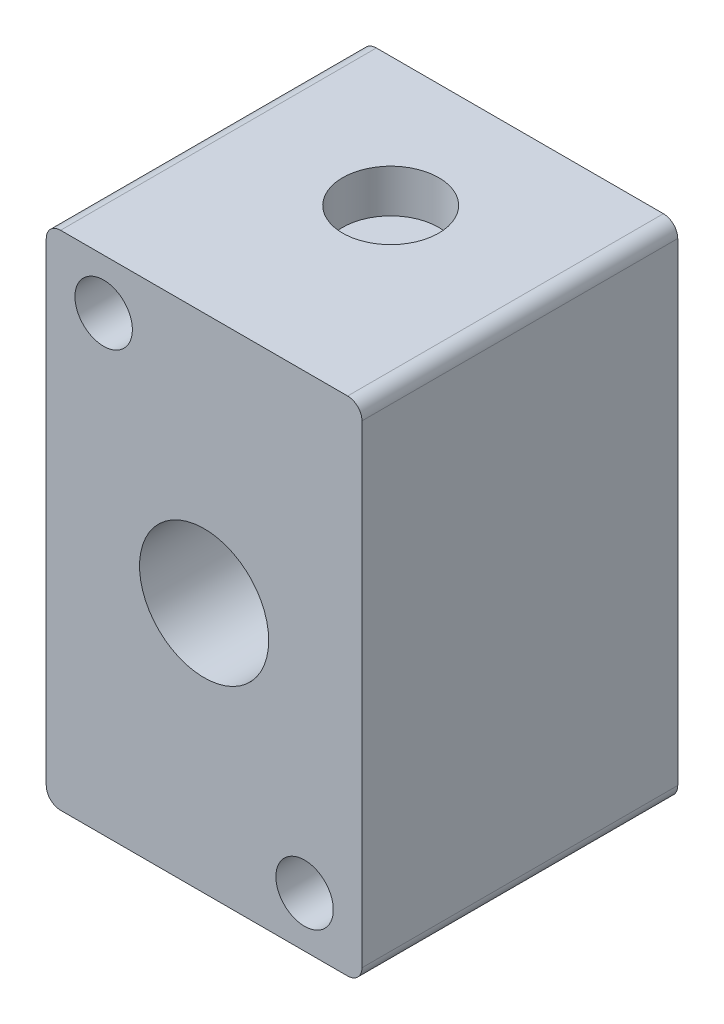
ISO-10303-21;
HEADER;
FILE_DESCRIPTION(('STEP AP214'),'2;1');
FILE_NAME('part.step','',(''),(''),'','','');
FILE_SCHEMA(('AUTOMOTIVE_DESIGN { 1 0 10303 214 1 1 1 1 }'));
ENDSEC;
DATA;
#1=APPLICATION_CONTEXT('core data for automotive mechanical design processes');
#2=APPLICATION_PROTOCOL_DEFINITION('international standard','automotive_design',2000,#1);
#3=PRODUCT_CONTEXT('',#1,'mechanical');
#4=PRODUCT('Part','Part','',(#3));
#5=PRODUCT_RELATED_PRODUCT_CATEGORY('part','',(#4));
#6=PRODUCT_DEFINITION_FORMATION('','',#4);
#7=PRODUCT_DEFINITION_CONTEXT('part definition',#1,'design');
#8=PRODUCT_DEFINITION('design','',#6,#7);
#9=PRODUCT_DEFINITION_SHAPE('','',#8);
#10=(LENGTH_UNIT() NAMED_UNIT(*) SI_UNIT(.MILLI.,.METRE.));
#11=(NAMED_UNIT(*) PLANE_ANGLE_UNIT() SI_UNIT($,.RADIAN.));
#12=(NAMED_UNIT(*) SI_UNIT($,.STERADIAN.) SOLID_ANGLE_UNIT());
#13=UNCERTAINTY_MEASURE_WITH_UNIT(LENGTH_MEASURE(1.E-05),#10,'distance_accuracy_value','');
#14=(GEOMETRIC_REPRESENTATION_CONTEXT(3) GLOBAL_UNCERTAINTY_ASSIGNED_CONTEXT((#13)) GLOBAL_UNIT_ASSIGNED_CONTEXT((#10,
#11,#12)) REPRESENTATION_CONTEXT('',''));
#15=CARTESIAN_POINT('',(0.,0.,0.));
#16=DIRECTION('',(0.,0.,1.));
#17=DIRECTION('',(1.,0.,0.));
#18=AXIS2_PLACEMENT_3D('',#15,#16,#17);
#19=CARTESIAN_POINT('',(-5.86092041698449,15.4504195270786,53.));
#20=DIRECTION('',(0.,1.,0.));
#21=DIRECTION('',(0.,0.,1.));
#22=AXIS2_PLACEMENT_3D('',#19,#20,#21);
#23=PLANE('',#22);
#24=CARTESIAN_POINT('',(-5.86092041698449,15.4504195270786,53.));
#25=DIRECTION('',(0.,-1.,0.));
#26=DIRECTION('',(0.,0.,-1.));
#27=AXIS2_PLACEMENT_3D('',#24,#25,#26);
#28=CIRCLE('',#27,3.35);
#29=CARTESIAN_POINT('',(-5.86092041698449,15.4504195270786,49.65));
#30=VERTEX_POINT('',#29);
#31=EDGE_CURVE('E158',#30,#30,#28,.F.);
#32=ORIENTED_EDGE('',*,*,#31,.T.);
#33=EDGE_LOOP('',(#32));
#34=FACE_BOUND('',#33,.T.);
#35=ADVANCED_FACE('F18',(#34),#23,.T.);
#36=CARTESIAN_POINT('',(-15.8609204169845,17.4504195270786,66.));
#37=DIRECTION('',(0.,0.,1.));
#38=DIRECTION('',(1.,0.,0.));
#39=AXIS2_PLACEMENT_3D('',#36,#37,#38);
#40=CYLINDRICAL_SURFACE('',#39,1.);
#41=CARTESIAN_POINT('',(-15.8609204169845,17.4504195270786,66.));
#42=DIRECTION('',(0.,0.,1.));
#43=DIRECTION('',(1.,0.,0.));
#44=AXIS2_PLACEMENT_3D('',#41,#42,#43);
#45=CIRCLE('',#44,1.);
#46=CARTESIAN_POINT('',(-16.8609204169845,17.4504195270786,66.));
#47=VERTEX_POINT('',#46);
#48=CARTESIAN_POINT('',(-15.8609204169845,18.4504195270786,66.));
#49=VERTEX_POINT('',#48);
#50=EDGE_CURVE('E90',#47,#49,#45,.F.);
#51=ORIENTED_EDGE('',*,*,#50,.T.);
#52=DIRECTION('',(0.,0.,1.));
#53=VECTOR('',#52,1.);
#54=CARTESIAN_POINT('',(-15.8609204169845,18.4504195270786,66.));
#55=LINE('',#54,#53);
#56=CARTESIAN_POINT('',(-15.8609204169845,18.4504195270786,44.));
#57=VERTEX_POINT('',#56);
#58=EDGE_CURVE('E88',#57,#49,#55,.T.);
#59=ORIENTED_EDGE('',*,*,#58,.F.);
#60=CARTESIAN_POINT('',(-15.8609204169845,17.4504195270786,44.));
#61=DIRECTION('',(0.,0.,1.));
#62=DIRECTION('',(1.,0.,0.));
#63=AXIS2_PLACEMENT_3D('',#60,#61,#62);
#64=CIRCLE('',#63,1.);
#65=CARTESIAN_POINT('',(-16.8609204169845,17.4504195270786,44.));
#66=VERTEX_POINT('',#65);
#67=EDGE_CURVE('E21',#57,#66,#64,.T.);
#68=ORIENTED_EDGE('',*,*,#67,.T.);
#69=DIRECTION('',(0.,0.,1.));
#70=VECTOR('',#69,1.);
#71=CARTESIAN_POINT('',(-16.8609204169845,17.4504195270786,66.));
#72=LINE('',#71,#70);
#73=EDGE_CURVE('E85',#47,#66,#72,.F.);
#74=ORIENTED_EDGE('',*,*,#73,.F.);
#75=EDGE_LOOP('',(#51,#59,#68,#74));
#76=FACE_BOUND('',#75,.T.);
#77=ADVANCED_FACE('F84',(#76),#40,.T.);
#78=CARTESIAN_POINT('',(-5.86092041698449,15.4504195270786,53.));
#79=DIRECTION('',(0.,-1.,0.));
#80=DIRECTION('',(0.,0.,-1.));
#81=AXIS2_PLACEMENT_3D('',#78,#79,#80);
#82=CYLINDRICAL_SURFACE('',#81,3.35);
#83=CARTESIAN_POINT('',(-5.86092041698449,18.4504195270786,53.));
#84=DIRECTION('',(0.,-1.,0.));
#85=DIRECTION('',(0.,0.,-1.));
#86=AXIS2_PLACEMENT_3D('',#83,#84,#85);
#87=CIRCLE('',#86,3.35);
#88=CARTESIAN_POINT('',(-5.86092041698449,18.4504195270786,49.65));
#89=VERTEX_POINT('',#88);
#90=EDGE_CURVE('E119',#89,#89,#87,.T.);
#91=ORIENTED_EDGE('',*,*,#90,.F.);
#92=EDGE_LOOP('',(#91));
#93=FACE_BOUND('',#92,.T.);
#94=ORIENTED_EDGE('',*,*,#31,.F.);
#95=EDGE_LOOP('',(#94));
#96=FACE_BOUND('',#95,.T.);
#97=ADVANCED_FACE('F189',(#93,#96),#82,.F.);
#98=CARTESIAN_POINT('',(-15.8609204169845,-15.5495804729214,66.));
#99=DIRECTION('',(0.,0.,1.));
#100=DIRECTION('',(1.,0.,0.));
#101=AXIS2_PLACEMENT_3D('',#98,#99,#100);
#102=CYLINDRICAL_SURFACE('',#101,1.);
#103=CARTESIAN_POINT('',(-15.8609204169845,-15.5495804729214,66.));
#104=DIRECTION('',(0.,0.,1.));
#105=DIRECTION('',(1.,0.,0.));
#106=AXIS2_PLACEMENT_3D('',#103,#104,#105);
#107=CIRCLE('',#106,1.);
#108=CARTESIAN_POINT('',(-15.8609204169845,-16.5495804729214,66.));
#109=VERTEX_POINT('',#108);
#110=CARTESIAN_POINT('',(-16.8609204169845,-15.5495804729214,66.));
#111=VERTEX_POINT('',#110);
#112=EDGE_CURVE('E99',#109,#111,#107,.F.);
#113=ORIENTED_EDGE('',*,*,#112,.T.);
#114=DIRECTION('',(0.,0.,1.));
#115=VECTOR('',#114,1.);
#116=CARTESIAN_POINT('',(-16.8609204169845,-15.5495804729214,66.));
#117=LINE('',#116,#115);
#118=CARTESIAN_POINT('',(-16.8609204169845,-15.5495804729214,44.));
#119=VERTEX_POINT('',#118);
#120=EDGE_CURVE('E98',#119,#111,#117,.T.);
#121=ORIENTED_EDGE('',*,*,#120,.F.);
#122=CARTESIAN_POINT('',(-15.8609204169845,-15.5495804729214,44.));
#123=DIRECTION('',(0.,0.,1.));
#124=DIRECTION('',(1.,0.,0.));
#125=AXIS2_PLACEMENT_3D('',#122,#123,#124);
#126=CIRCLE('',#125,1.);
#127=CARTESIAN_POINT('',(-15.8609204169845,-16.5495804729214,44.));
#128=VERTEX_POINT('',#127);
#129=EDGE_CURVE('E103',#119,#128,#126,.T.);
#130=ORIENTED_EDGE('',*,*,#129,.T.);
#131=DIRECTION('',(0.,0.,1.));
#132=VECTOR('',#131,1.);
#133=CARTESIAN_POINT('',(-15.8609204169845,-16.5495804729214,66.));
#134=LINE('',#133,#132);
#135=EDGE_CURVE('E110',#109,#128,#134,.F.);
#136=ORIENTED_EDGE('',*,*,#135,.F.);
#137=EDGE_LOOP('',(#113,#121,#130,#136));
#138=FACE_BOUND('',#137,.T.);
#139=ADVANCED_FACE('F187',(#138),#102,.T.);
#140=CARTESIAN_POINT('',(-16.8609204169845,18.4504195270786,66.));
#141=DIRECTION('',(-1.,0.,0.));
#142=DIRECTION('',(0.,-1.,0.));
#143=AXIS2_PLACEMENT_3D('',#140,#141,#142);
#144=PLANE('',#143);
#145=DIRECTION('',(0.,1.,0.));
#146=VECTOR('',#145,1.);
#147=CARTESIAN_POINT('',(-16.8609204169845,0.950419527078566,44.));
#148=LINE('',#147,#146);
#149=EDGE_CURVE('E95',#66,#119,#148,.F.);
#150=ORIENTED_EDGE('',*,*,#149,.T.);
#151=ORIENTED_EDGE('',*,*,#120,.T.);
#152=DIRECTION('',(0.,1.,0.));
#153=VECTOR('',#152,1.);
#154=CARTESIAN_POINT('',(-16.8609204169845,0.950419527078566,66.));
#155=LINE('',#154,#153);
#156=EDGE_CURVE('E97',#47,#111,#155,.F.);
#157=ORIENTED_EDGE('',*,*,#156,.F.);
#158=ORIENTED_EDGE('',*,*,#73,.T.);
#159=EDGE_LOOP('',(#150,#151,#157,#158));
#160=FACE_BOUND('',#159,.T.);
#161=ADVANCED_FACE('F93',(#160),#144,.T.);
#162=CARTESIAN_POINT('',(5.13907958301551,18.4504195270786,66.));
#163=DIRECTION('',(0.,1.,0.));
#164=DIRECTION('',(0.,0.,1.));
#165=AXIS2_PLACEMENT_3D('',#162,#163,#164);
#166=PLANE('',#165);
#167=ORIENTED_EDGE('',*,*,#90,.T.);
#168=EDGE_LOOP('',(#167));
#169=FACE_BOUND('',#168,.T.);
#170=DIRECTION('',(1.,0.,0.));
#171=VECTOR('',#170,1.);
#172=CARTESIAN_POINT('',(-5.86092041698449,18.4504195270786,66.));
#173=LINE('',#172,#171);
#174=CARTESIAN_POINT('',(4.13907958301551,18.4504195270786,66.));
#175=VERTEX_POINT('',#174);
#176=EDGE_CURVE('E139',#175,#49,#173,.F.);
#177=ORIENTED_EDGE('',*,*,#176,.F.);
#178=DIRECTION('',(0.,0.,1.));
#179=VECTOR('',#178,1.);
#180=CARTESIAN_POINT('',(4.13907958301551,18.4504195270786,66.));
#181=LINE('',#180,#179);
#182=CARTESIAN_POINT('',(4.13907958301551,18.4504195270786,44.));
#183=VERTEX_POINT('',#182);
#184=EDGE_CURVE('E120',#183,#175,#181,.T.);
#185=ORIENTED_EDGE('',*,*,#184,.F.);
#186=DIRECTION('',(1.,0.,0.));
#187=VECTOR('',#186,1.);
#188=CARTESIAN_POINT('',(-5.86092041698449,18.4504195270786,44.));
#189=LINE('',#188,#187);
#190=EDGE_CURVE('E106',#183,#57,#189,.F.);
#191=ORIENTED_EDGE('',*,*,#190,.T.);
#192=ORIENTED_EDGE('',*,*,#58,.T.);
#193=EDGE_LOOP('',(#177,#185,#191,#192));
#194=FACE_BOUND('',#193,.T.);
#195=ADVANCED_FACE('F163',(#169,#194),#166,.T.);
#196=CARTESIAN_POINT('',(-5.86092041698449,0.950419527078566,66.));
#197=DIRECTION('',(0.,0.,1.));
#198=DIRECTION('',(1.,0.,0.));
#199=AXIS2_PLACEMENT_3D('',#196,#197,#198);
#200=CYLINDRICAL_SURFACE('',#199,4.5);
#201=CARTESIAN_POINT('',(-5.86092041698449,0.950419527078566,66.));
#202=DIRECTION('',(0.,0.,1.));
#203=DIRECTION('',(1.,0.,0.));
#204=AXIS2_PLACEMENT_3D('',#201,#202,#203);
#205=CIRCLE('',#204,4.5);
#206=CARTESIAN_POINT('',(-1.36092041698449,0.950419527078566,66.));
#207=VERTEX_POINT('',#206);
#208=EDGE_CURVE('E136',#207,#207,#205,.F.);
#209=ORIENTED_EDGE('',*,*,#208,.F.);
#210=EDGE_LOOP('',(#209));
#211=FACE_BOUND('',#210,.T.);
#212=CARTESIAN_POINT('',(-5.86092041698449,0.950419527078566,44.));
#213=DIRECTION('',(0.,0.,1.));
#214=DIRECTION('',(1.,0.,0.));
#215=AXIS2_PLACEMENT_3D('',#212,#213,#214);
#216=CIRCLE('',#215,4.5);
#217=CARTESIAN_POINT('',(-1.36092041698449,0.950419527078566,44.));
#218=VERTEX_POINT('',#217);
#219=EDGE_CURVE('E108',#218,#218,#216,.F.);
#220=ORIENTED_EDGE('',*,*,#219,.T.);
#221=EDGE_LOOP('',(#220));
#222=FACE_BOUND('',#221,.T.);
#223=ADVANCED_FACE('F225',(#211,#222),#200,.F.);
#224=CARTESIAN_POINT('',(-12.8609204169845,14.9504195270786,44.));
#225=DIRECTION('',(0.,0.,-1.));
#226=DIRECTION('',(-1.,0.,0.));
#227=AXIS2_PLACEMENT_3D('',#224,#225,#226);
#228=CYLINDRICAL_SURFACE('',#227,2.);
#229=CARTESIAN_POINT('',(-12.8609204169845,14.9504195270786,66.));
#230=DIRECTION('',(0.,0.,-1.));
#231=DIRECTION('',(-1.,0.,0.));
#232=AXIS2_PLACEMENT_3D('',#229,#230,#231);
#233=CIRCLE('',#232,2.);
#234=CARTESIAN_POINT('',(-14.8609204169845,14.9504195270786,66.));
#235=VERTEX_POINT('',#234);
#236=EDGE_CURVE('E133',#235,#235,#233,.T.);
#237=ORIENTED_EDGE('',*,*,#236,.F.);
#238=EDGE_LOOP('',(#237));
#239=FACE_BOUND('',#238,.T.);
#240=CARTESIAN_POINT('',(-12.8609204169845,14.9504195270786,44.));
#241=DIRECTION('',(0.,0.,-1.));
#242=DIRECTION('',(-1.,0.,0.));
#243=AXIS2_PLACEMENT_3D('',#240,#241,#242);
#244=CIRCLE('',#243,2.);
#245=CARTESIAN_POINT('',(-14.8609204169845,14.9504195270786,44.));
#246=VERTEX_POINT('',#245);
#247=EDGE_CURVE('E149',#246,#246,#244,.T.);
#248=ORIENTED_EDGE('',*,*,#247,.T.);
#249=EDGE_LOOP('',(#248));
#250=FACE_BOUND('',#249,.T.);
#251=ADVANCED_FACE('F221',(#239,#250),#228,.F.);
#252=CARTESIAN_POINT('',(1.13907958301552,-13.0495804729214,44.));
#253=DIRECTION('',(0.,0.,-1.));
#254=DIRECTION('',(-1.,0.,0.));
#255=AXIS2_PLACEMENT_3D('',#252,#253,#254);
#256=CYLINDRICAL_SURFACE('',#255,2.);
#257=CARTESIAN_POINT('',(1.13907958301552,-13.0495804729214,66.));
#258=DIRECTION('',(0.,0.,-1.));
#259=DIRECTION('',(-1.,0.,0.));
#260=AXIS2_PLACEMENT_3D('',#257,#258,#259);
#261=CIRCLE('',#260,2.);
#262=CARTESIAN_POINT('',(-0.860920416984483,-13.0495804729214,66.));
#263=VERTEX_POINT('',#262);
#264=EDGE_CURVE('E130',#263,#263,#261,.T.);
#265=ORIENTED_EDGE('',*,*,#264,.F.);
#266=EDGE_LOOP('',(#265));
#267=FACE_BOUND('',#266,.T.);
#268=CARTESIAN_POINT('',(1.13907958301552,-13.0495804729214,44.));
#269=DIRECTION('',(0.,0.,-1.));
#270=DIRECTION('',(-1.,0.,0.));
#271=AXIS2_PLACEMENT_3D('',#268,#269,#270);
#272=CIRCLE('',#271,2.);
#273=CARTESIAN_POINT('',(-0.860920416984483,-13.0495804729214,44.));
#274=VERTEX_POINT('',#273);
#275=EDGE_CURVE('E146',#274,#274,#272,.T.);
#276=ORIENTED_EDGE('',*,*,#275,.T.);
#277=EDGE_LOOP('',(#276));
#278=FACE_BOUND('',#277,.T.);
#279=ADVANCED_FACE('F218',(#267,#278),#256,.F.);
#280=CARTESIAN_POINT('',(-16.8609204169845,-16.5495804729214,66.));
#281=DIRECTION('',(0.,-1.,0.));
#282=DIRECTION('',(1.,0.,0.));
#283=AXIS2_PLACEMENT_3D('',#280,#281,#282);
#284=PLANE('',#283);
#285=DIRECTION('',(1.,0.,0.));
#286=VECTOR('',#285,1.);
#287=CARTESIAN_POINT('',(-5.86092041698449,-16.5495804729214,44.));
#288=LINE('',#287,#286);
#289=CARTESIAN_POINT('',(4.13907958301551,-16.5495804729214,44.));
#290=VERTEX_POINT('',#289);
#291=EDGE_CURVE('E105',#128,#290,#288,.T.);
#292=ORIENTED_EDGE('',*,*,#291,.T.);
#293=DIRECTION('',(0.,0.,1.));
#294=VECTOR('',#293,1.);
#295=CARTESIAN_POINT('',(4.13907958301551,-16.5495804729214,66.));
#296=LINE('',#295,#294);
#297=CARTESIAN_POINT('',(4.13907958301551,-16.5495804729214,66.));
#298=VERTEX_POINT('',#297);
#299=EDGE_CURVE('E114',#298,#290,#296,.F.);
#300=ORIENTED_EDGE('',*,*,#299,.F.);
#301=DIRECTION('',(1.,0.,0.));
#302=VECTOR('',#301,1.);
#303=CARTESIAN_POINT('',(-5.86092041698449,-16.5495804729214,66.));
#304=LINE('',#303,#302);
#305=EDGE_CURVE('E143',#109,#298,#304,.T.);
#306=ORIENTED_EDGE('',*,*,#305,.F.);
#307=ORIENTED_EDGE('',*,*,#135,.T.);
#308=EDGE_LOOP('',(#292,#300,#306,#307));
#309=FACE_BOUND('',#308,.T.);
#310=ADVANCED_FACE('F184',(#309),#284,.T.);
#311=CARTESIAN_POINT('',(-5.86092041698449,0.950419527078566,44.));
#312=DIRECTION('',(0.,0.,1.));
#313=DIRECTION('',(1.,0.,0.));
#314=AXIS2_PLACEMENT_3D('',#311,#312,#313);
#315=PLANE('',#314);
#316=ORIENTED_EDGE('',*,*,#275,.F.);
#317=EDGE_LOOP('',(#316));
#318=FACE_BOUND('',#317,.T.);
#319=ORIENTED_EDGE('',*,*,#247,.F.);
#320=EDGE_LOOP('',(#319));
#321=FACE_BOUND('',#320,.T.);
#322=ORIENTED_EDGE('',*,*,#219,.F.);
#323=EDGE_LOOP('',(#322));
#324=FACE_BOUND('',#323,.T.);
#325=ORIENTED_EDGE('',*,*,#291,.F.);
#326=ORIENTED_EDGE('',*,*,#129,.F.);
#327=ORIENTED_EDGE('',*,*,#149,.F.);
#328=ORIENTED_EDGE('',*,*,#67,.F.);
#329=ORIENTED_EDGE('',*,*,#190,.F.);
#330=CARTESIAN_POINT('',(4.13907958301551,17.4504195270786,44.));
#331=DIRECTION('',(0.,0.,1.));
#332=DIRECTION('',(1.,0.,0.));
#333=AXIS2_PLACEMENT_3D('',#330,#331,#332);
#334=CIRCLE('',#333,1.);
#335=CARTESIAN_POINT('',(5.13907958301551,17.4504195270786,44.));
#336=VERTEX_POINT('',#335);
#337=EDGE_CURVE('E122',#336,#183,#334,.T.);
#338=ORIENTED_EDGE('',*,*,#337,.F.);
#339=DIRECTION('',(0.,1.,0.));
#340=VECTOR('',#339,1.);
#341=CARTESIAN_POINT('',(5.13907958301551,-16.5495804729214,44.));
#342=LINE('',#341,#340);
#343=CARTESIAN_POINT('',(5.13907958301551,-15.5495804729214,44.));
#344=VERTEX_POINT('',#343);
#345=EDGE_CURVE('E117',#344,#336,#342,.T.);
#346=ORIENTED_EDGE('',*,*,#345,.F.);
#347=CARTESIAN_POINT('',(4.13907958301551,-15.5495804729214,44.));
#348=DIRECTION('',(0.,0.,1.));
#349=DIRECTION('',(1.,0.,0.));
#350=AXIS2_PLACEMENT_3D('',#347,#348,#349);
#351=CIRCLE('',#350,1.);
#352=EDGE_CURVE('E127',#290,#344,#351,.T.);
#353=ORIENTED_EDGE('',*,*,#352,.F.);
#354=EDGE_LOOP('',(#325,#326,#327,#328,#329,#338,#346,#353));
#355=FACE_BOUND('',#354,.T.);
#356=ADVANCED_FACE('F102',(#318,#321,#324,#355),#315,.F.);
#357=CARTESIAN_POINT('',(4.13907958301551,17.4504195270786,66.));
#358=DIRECTION('',(0.,0.,1.));
#359=DIRECTION('',(1.,0.,0.));
#360=AXIS2_PLACEMENT_3D('',#357,#358,#359);
#361=CYLINDRICAL_SURFACE('',#360,1.);
#362=CARTESIAN_POINT('',(4.13907958301551,17.4504195270786,66.));
#363=DIRECTION('',(0.,0.,1.));
#364=DIRECTION('',(1.,0.,0.));
#365=AXIS2_PLACEMENT_3D('',#362,#363,#364);
#366=CIRCLE('',#365,1.);
#367=CARTESIAN_POINT('',(5.13907958301551,17.4504195270786,66.));
#368=VERTEX_POINT('',#367);
#369=EDGE_CURVE('E140',#368,#175,#366,.T.);
#370=ORIENTED_EDGE('',*,*,#369,.F.);
#371=DIRECTION('',(0.,0.,-1.));
#372=VECTOR('',#371,1.);
#373=CARTESIAN_POINT('',(5.13907958301551,17.4504195270786,66.));
#374=LINE('',#373,#372);
#375=EDGE_CURVE('E170',#336,#368,#374,.F.);
#376=ORIENTED_EDGE('',*,*,#375,.F.);
#377=ORIENTED_EDGE('',*,*,#337,.T.);
#378=ORIENTED_EDGE('',*,*,#184,.T.);
#379=EDGE_LOOP('',(#370,#376,#377,#378));
#380=FACE_BOUND('',#379,.T.);
#381=ADVANCED_FACE('F208',(#380),#361,.T.);
#382=CARTESIAN_POINT('',(-5.86092041698449,0.950419527078566,66.));
#383=DIRECTION('',(0.,0.,1.));
#384=DIRECTION('',(1.,0.,0.));
#385=AXIS2_PLACEMENT_3D('',#382,#383,#384);
#386=PLANE('',#385);
#387=ORIENTED_EDGE('',*,*,#264,.T.);
#388=EDGE_LOOP('',(#387));
#389=FACE_BOUND('',#388,.T.);
#390=ORIENTED_EDGE('',*,*,#236,.T.);
#391=EDGE_LOOP('',(#390));
#392=FACE_BOUND('',#391,.T.);
#393=ORIENTED_EDGE('',*,*,#208,.T.);
#394=EDGE_LOOP('',(#393));
#395=FACE_BOUND('',#394,.T.);
#396=ORIENTED_EDGE('',*,*,#176,.T.);
#397=ORIENTED_EDGE('',*,*,#50,.F.);
#398=ORIENTED_EDGE('',*,*,#156,.T.);
#399=ORIENTED_EDGE('',*,*,#112,.F.);
#400=ORIENTED_EDGE('',*,*,#305,.T.);
#401=CARTESIAN_POINT('',(4.13907958301551,-15.5495804729214,66.));
#402=DIRECTION('',(0.,0.,1.));
#403=DIRECTION('',(1.,0.,0.));
#404=AXIS2_PLACEMENT_3D('',#401,#402,#403);
#405=CIRCLE('',#404,1.);
#406=CARTESIAN_POINT('',(5.13907958301551,-15.5495804729214,66.));
#407=VERTEX_POINT('',#406);
#408=EDGE_CURVE('E36',#407,#298,#405,.F.);
#409=ORIENTED_EDGE('',*,*,#408,.F.);
#410=DIRECTION('',(0.,1.,0.));
#411=VECTOR('',#410,1.);
#412=CARTESIAN_POINT('',(5.13907958301551,-16.5495804729214,66.));
#413=LINE('',#412,#411);
#414=EDGE_CURVE('E27',#368,#407,#413,.F.);
#415=ORIENTED_EDGE('',*,*,#414,.F.);
#416=ORIENTED_EDGE('',*,*,#369,.T.);
#417=EDGE_LOOP('',(#396,#397,#398,#399,#400,#409,#415,#416));
#418=FACE_BOUND('',#417,.T.);
#419=ADVANCED_FACE('F165',(#389,#392,#395,#418),#386,.T.);
#420=CARTESIAN_POINT('',(4.13907958301551,-15.5495804729214,66.));
#421=DIRECTION('',(0.,0.,1.));
#422=DIRECTION('',(1.,0.,0.));
#423=AXIS2_PLACEMENT_3D('',#420,#421,#422);
#424=CYLINDRICAL_SURFACE('',#423,1.);
#425=ORIENTED_EDGE('',*,*,#408,.T.);
#426=ORIENTED_EDGE('',*,*,#299,.T.);
#427=ORIENTED_EDGE('',*,*,#352,.T.);
#428=DIRECTION('',(0.,0.,-1.));
#429=VECTOR('',#428,1.);
#430=CARTESIAN_POINT('',(5.13907958301551,-15.5495804729214,66.));
#431=LINE('',#430,#429);
#432=EDGE_CURVE('E11',#407,#344,#431,.T.);
#433=ORIENTED_EDGE('',*,*,#432,.F.);
#434=EDGE_LOOP('',(#425,#426,#427,#433));
#435=FACE_BOUND('',#434,.T.);
#436=ADVANCED_FACE('F180',(#435),#424,.T.);
#437=CARTESIAN_POINT('',(5.13907958301551,-16.5495804729214,66.));
#438=DIRECTION('',(1.,0.,0.));
#439=DIRECTION('',(0.,0.,-1.));
#440=AXIS2_PLACEMENT_3D('',#437,#438,#439);
#441=PLANE('',#440);
#442=ORIENTED_EDGE('',*,*,#414,.T.);
#443=ORIENTED_EDGE('',*,*,#432,.T.);
#444=ORIENTED_EDGE('',*,*,#345,.T.);
#445=ORIENTED_EDGE('',*,*,#375,.T.);
#446=EDGE_LOOP('',(#442,#443,#444,#445));
#447=FACE_BOUND('',#446,.T.);
#448=ADVANCED_FACE('F176',(#447),#441,.T.);
#449=CLOSED_SHELL('',(#35,#77,#97,#139,#161,#195,#223,#251,#279,#310,#356,#381,#419,#436,#448));
#450=MANIFOLD_SOLID_BREP('B1',#449);
#451=ADVANCED_BREP_SHAPE_REPRESENTATION('',(#18,#450),#14);
#452=SHAPE_DEFINITION_REPRESENTATION(#9,#451);
ENDSEC;
END-ISO-10303-21;
